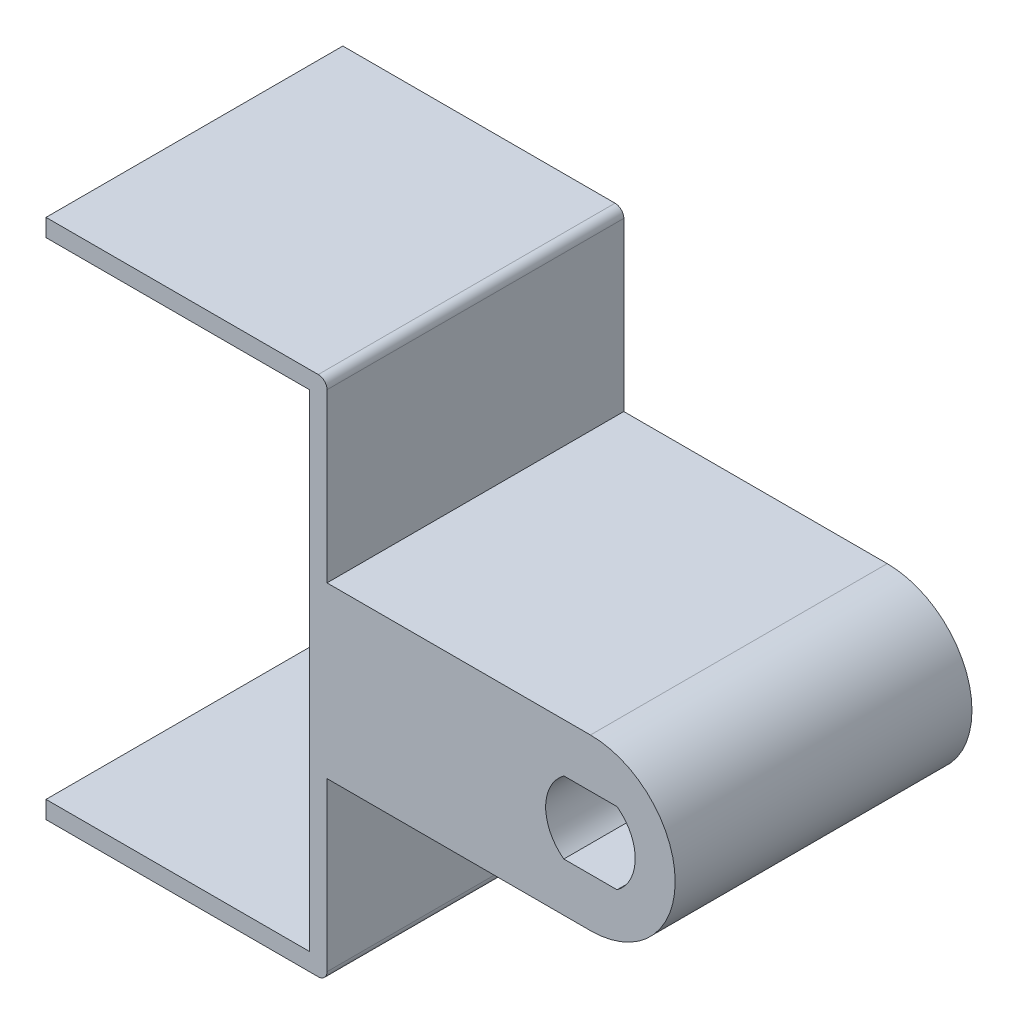
ISO-10303-21;
HEADER;
FILE_DESCRIPTION(('STEP AP214'),'2;1');
FILE_NAME('part.step','',(''),(''),'','','');
FILE_SCHEMA(('AUTOMOTIVE_DESIGN { 1 0 10303 214 1 1 1 1 }'));
ENDSEC;
DATA;
#1=APPLICATION_CONTEXT('core data for automotive mechanical design processes');
#2=APPLICATION_PROTOCOL_DEFINITION('international standard','automotive_design',2000,#1);
#3=PRODUCT_CONTEXT('',#1,'mechanical');
#4=PRODUCT('Part','Part','',(#3));
#5=PRODUCT_RELATED_PRODUCT_CATEGORY('part','',(#4));
#6=PRODUCT_DEFINITION_FORMATION('','',#4);
#7=PRODUCT_DEFINITION_CONTEXT('part definition',#1,'design');
#8=PRODUCT_DEFINITION('design','',#6,#7);
#9=PRODUCT_DEFINITION_SHAPE('','',#8);
#10=(LENGTH_UNIT() NAMED_UNIT(*) SI_UNIT(.MILLI.,.METRE.));
#11=(NAMED_UNIT(*) PLANE_ANGLE_UNIT() SI_UNIT($,.RADIAN.));
#12=(NAMED_UNIT(*) SI_UNIT($,.STERADIAN.) SOLID_ANGLE_UNIT());
#13=UNCERTAINTY_MEASURE_WITH_UNIT(LENGTH_MEASURE(1.E-05),#10,'distance_accuracy_value','');
#14=(GEOMETRIC_REPRESENTATION_CONTEXT(3) GLOBAL_UNCERTAINTY_ASSIGNED_CONTEXT((#13)) GLOBAL_UNIT_ASSIGNED_CONTEXT((#10,
#11,#12)) REPRESENTATION_CONTEXT('',''));
#15=CARTESIAN_POINT('',(0.,0.,0.));
#16=DIRECTION('',(0.,0.,1.));
#17=DIRECTION('',(1.,0.,0.));
#18=AXIS2_PLACEMENT_3D('',#15,#16,#17);
#19=CARTESIAN_POINT('',(21.,-14.85,16.9));
#20=DIRECTION('',(-1.,0.,0.));
#21=DIRECTION('',(0.,0.,1.));
#22=AXIS2_PLACEMENT_3D('',#19,#20,#21);
#23=PLANE('',#22);
#24=DIRECTION('',(0.,1.,0.));
#25=VECTOR('',#24,1.);
#26=CARTESIAN_POINT('',(21.,-14.85,0.));
#27=LINE('',#26,#25);
#28=CARTESIAN_POINT('',(21.,4.825,0.));
#29=VERTEX_POINT('',#28);
#30=CARTESIAN_POINT('',(21.,14.35,0.));
#31=VERTEX_POINT('',#30);
#32=EDGE_CURVE('E220',#29,#31,#27,.T.);
#33=ORIENTED_EDGE('',*,*,#32,.T.);
#34=DIRECTION('',(0.,0.,-1.));
#35=VECTOR('',#34,1.);
#36=CARTESIAN_POINT('',(21.,14.35,16.9));
#37=LINE('',#36,#35);
#38=CARTESIAN_POINT('',(21.,14.35,16.9));
#39=VERTEX_POINT('',#38);
#40=EDGE_CURVE('E51',#31,#39,#37,.F.);
#41=ORIENTED_EDGE('',*,*,#40,.T.);
#42=DIRECTION('',(0.,1.,0.));
#43=VECTOR('',#42,1.);
#44=CARTESIAN_POINT('',(21.,-14.85,16.9));
#45=LINE('',#44,#43);
#46=CARTESIAN_POINT('',(21.,4.825,16.9));
#47=VERTEX_POINT('',#46);
#48=EDGE_CURVE('E209',#47,#39,#45,.T.);
#49=ORIENTED_EDGE('',*,*,#48,.F.);
#50=DIRECTION('',(0.,0.,-1.));
#51=VECTOR('',#50,1.);
#52=CARTESIAN_POINT('',(21.,4.825,13.5));
#53=LINE('',#52,#51);
#54=EDGE_CURVE('E340',#47,#29,#53,.T.);
#55=ORIENTED_EDGE('',*,*,#54,.T.);
#56=EDGE_LOOP('',(#33,#41,#49,#55));
#57=FACE_BOUND('',#56,.T.);
#58=ADVANCED_FACE('F43',(#57),#23,.F.);
#59=CARTESIAN_POINT('',(21.,-14.35,16.9));
#60=VERTEX_POINT('',#59);
#61=CARTESIAN_POINT('',(21.,-4.825,16.9));
#62=VERTEX_POINT('',#61);
#63=EDGE_CURVE('E205',#60,#62,#45,.T.);
#64=ORIENTED_EDGE('',*,*,#63,.F.);
#65=DIRECTION('',(0.,0.,-1.));
#66=VECTOR('',#65,1.);
#67=CARTESIAN_POINT('',(21.,-14.35,16.9));
#68=LINE('',#67,#66);
#69=CARTESIAN_POINT('',(21.,-14.35,0.));
#70=VERTEX_POINT('',#69);
#71=EDGE_CURVE('E12',#60,#70,#68,.T.);
#72=ORIENTED_EDGE('',*,*,#71,.T.);
#73=CARTESIAN_POINT('',(21.,-4.825,0.));
#74=VERTEX_POINT('',#73);
#75=EDGE_CURVE('E222',#70,#74,#27,.T.);
#76=ORIENTED_EDGE('',*,*,#75,.T.);
#77=DIRECTION('',(0.,0.,-1.));
#78=VECTOR('',#77,1.);
#79=CARTESIAN_POINT('',(21.,-4.825,13.5));
#80=LINE('',#79,#78);
#81=EDGE_CURVE('E221',#62,#74,#80,.T.);
#82=ORIENTED_EDGE('',*,*,#81,.F.);
#83=EDGE_LOOP('',(#64,#72,#76,#82));
#84=FACE_BOUND('',#83,.T.);
#85=ADVANCED_FACE('F315',(#84),#23,.F.);
#86=CARTESIAN_POINT('',(-20.,-14.85,16.9));
#87=DIRECTION('',(0.,1.,0.));
#88=DIRECTION('',(0.,0.,1.));
#89=AXIS2_PLACEMENT_3D('',#86,#87,#88);
#90=PLANE('',#89);
#91=DIRECTION('',(1.,0.,0.));
#92=VECTOR('',#91,1.);
#93=CARTESIAN_POINT('',(-20.,-14.85,16.9));
#94=LINE('',#93,#92);
#95=CARTESIAN_POINT('',(5.,-14.85,16.9));
#96=VERTEX_POINT('',#95);
#97=CARTESIAN_POINT('',(20.5,-14.85,16.9));
#98=VERTEX_POINT('',#97);
#99=EDGE_CURVE('E232',#96,#98,#94,.T.);
#100=ORIENTED_EDGE('',*,*,#99,.F.);
#101=DIRECTION('',(0.,0.,-1.));
#102=VECTOR('',#101,1.);
#103=CARTESIAN_POINT('',(5.,-14.85,16.9));
#104=LINE('',#103,#102);
#105=CARTESIAN_POINT('',(5.,-14.85,0.));
#106=VERTEX_POINT('',#105);
#107=EDGE_CURVE('E196',#96,#106,#104,.T.);
#108=ORIENTED_EDGE('',*,*,#107,.T.);
#109=DIRECTION('',(1.,0.,0.));
#110=VECTOR('',#109,1.);
#111=CARTESIAN_POINT('',(-20.,-14.85,0.));
#112=LINE('',#111,#110);
#113=CARTESIAN_POINT('',(20.5,-14.85,0.));
#114=VERTEX_POINT('',#113);
#115=EDGE_CURVE('E218',#106,#114,#112,.T.);
#116=ORIENTED_EDGE('',*,*,#115,.T.);
#117=DIRECTION('',(0.,0.,-1.));
#118=VECTOR('',#117,1.);
#119=CARTESIAN_POINT('',(20.5,-14.85,16.9));
#120=LINE('',#119,#118);
#121=EDGE_CURVE('E337',#114,#98,#120,.F.);
#122=ORIENTED_EDGE('',*,*,#121,.T.);
#123=EDGE_LOOP('',(#100,#108,#116,#122));
#124=FACE_BOUND('',#123,.T.);
#125=ADVANCED_FACE('F321',(#124),#90,.F.);
#126=CARTESIAN_POINT('',(21.,14.85,16.9));
#127=DIRECTION('',(0.,-1.,0.));
#128=DIRECTION('',(1.,0.,0.));
#129=AXIS2_PLACEMENT_3D('',#126,#127,#128);
#130=PLANE('',#129);
#131=DIRECTION('',(-1.,0.,0.));
#132=VECTOR('',#131,1.);
#133=CARTESIAN_POINT('',(21.,14.85,0.));
#134=LINE('',#133,#132);
#135=CARTESIAN_POINT('',(20.5,14.85,0.));
#136=VERTEX_POINT('',#135);
#137=CARTESIAN_POINT('',(5.,14.85,0.));
#138=VERTEX_POINT('',#137);
#139=EDGE_CURVE('E195',#136,#138,#134,.T.);
#140=ORIENTED_EDGE('',*,*,#139,.T.);
#141=DIRECTION('',(0.,0.,-1.));
#142=VECTOR('',#141,1.);
#143=CARTESIAN_POINT('',(5.,14.85,16.9));
#144=LINE('',#143,#142);
#145=CARTESIAN_POINT('',(5.,14.85,16.9));
#146=VERTEX_POINT('',#145);
#147=EDGE_CURVE('E66',#146,#138,#144,.T.);
#148=ORIENTED_EDGE('',*,*,#147,.F.);
#149=DIRECTION('',(-1.,0.,0.));
#150=VECTOR('',#149,1.);
#151=CARTESIAN_POINT('',(21.,14.85,16.9));
#152=LINE('',#151,#150);
#153=CARTESIAN_POINT('',(20.5,14.85,16.9));
#154=VERTEX_POINT('',#153);
#155=EDGE_CURVE('E192',#154,#146,#152,.T.);
#156=ORIENTED_EDGE('',*,*,#155,.F.);
#157=DIRECTION('',(0.,0.,-1.));
#158=VECTOR('',#157,1.);
#159=CARTESIAN_POINT('',(20.5,14.85,16.9));
#160=LINE('',#159,#158);
#161=EDGE_CURVE('E698',#154,#136,#160,.T.);
#162=ORIENTED_EDGE('',*,*,#161,.T.);
#163=EDGE_LOOP('',(#140,#148,#156,#162));
#164=FACE_BOUND('',#163,.T.);
#165=ADVANCED_FACE('F190',(#164),#130,.F.);
#166=CARTESIAN_POINT('',(20.,13.85,16.9));
#167=DIRECTION('',(0.,1.,0.));
#168=DIRECTION('',(0.,0.,1.));
#169=AXIS2_PLACEMENT_3D('',#166,#167,#168);
#170=PLANE('',#169);
#171=DIRECTION('',(1.,0.,0.));
#172=VECTOR('',#171,1.);
#173=CARTESIAN_POINT('',(20.,13.85,16.9));
#174=LINE('',#173,#172);
#175=CARTESIAN_POINT('',(5.,13.85,16.9));
#176=VERTEX_POINT('',#175);
#177=CARTESIAN_POINT('',(20.,13.85,16.9));
#178=VERTEX_POINT('',#177);
#179=EDGE_CURVE('E204',#176,#178,#174,.T.);
#180=ORIENTED_EDGE('',*,*,#179,.F.);
#181=DIRECTION('',(0.,0.,-1.));
#182=VECTOR('',#181,1.);
#183=CARTESIAN_POINT('',(5.,13.85,16.9));
#184=LINE('',#183,#182);
#185=CARTESIAN_POINT('',(5.,13.85,0.));
#186=VERTEX_POINT('',#185);
#187=EDGE_CURVE('E181',#176,#186,#184,.T.);
#188=ORIENTED_EDGE('',*,*,#187,.T.);
#189=DIRECTION('',(1.,0.,0.));
#190=VECTOR('',#189,1.);
#191=CARTESIAN_POINT('',(20.,13.85,0.));
#192=LINE('',#191,#190);
#193=CARTESIAN_POINT('',(20.,13.85,0.));
#194=VERTEX_POINT('',#193);
#195=EDGE_CURVE('E225',#186,#194,#192,.T.);
#196=ORIENTED_EDGE('',*,*,#195,.T.);
#197=DIRECTION('',(0.,0.,-1.));
#198=VECTOR('',#197,1.);
#199=CARTESIAN_POINT('',(20.,13.85,16.9));
#200=LINE('',#199,#198);
#201=EDGE_CURVE('E235',#178,#194,#200,.T.);
#202=ORIENTED_EDGE('',*,*,#201,.F.);
#203=EDGE_LOOP('',(#180,#188,#196,#202));
#204=FACE_BOUND('',#203,.T.);
#205=ADVANCED_FACE('F331',(#204),#170,.F.);
#206=CARTESIAN_POINT('',(20.,-13.85,16.9));
#207=DIRECTION('',(1.,0.,0.));
#208=DIRECTION('',(0.,0.,-1.));
#209=AXIS2_PLACEMENT_3D('',#206,#207,#208);
#210=PLANE('',#209);
#211=DIRECTION('',(0.,-1.,0.));
#212=VECTOR('',#211,1.);
#213=CARTESIAN_POINT('',(20.,-13.85,0.));
#214=LINE('',#213,#212);
#215=CARTESIAN_POINT('',(20.,-13.85,0.));
#216=VERTEX_POINT('',#215);
#217=EDGE_CURVE('E227',#194,#216,#214,.T.);
#218=ORIENTED_EDGE('',*,*,#217,.T.);
#219=DIRECTION('',(0.,0.,-1.));
#220=VECTOR('',#219,1.);
#221=CARTESIAN_POINT('',(20.,-13.85,16.9));
#222=LINE('',#221,#220);
#223=CARTESIAN_POINT('',(20.,-13.85,16.9));
#224=VERTEX_POINT('',#223);
#225=EDGE_CURVE('E217',#224,#216,#222,.T.);
#226=ORIENTED_EDGE('',*,*,#225,.F.);
#227=DIRECTION('',(0.,-1.,0.));
#228=VECTOR('',#227,1.);
#229=CARTESIAN_POINT('',(20.,-13.85,16.9));
#230=LINE('',#229,#228);
#231=EDGE_CURVE('E207',#178,#224,#230,.T.);
#232=ORIENTED_EDGE('',*,*,#231,.F.);
#233=ORIENTED_EDGE('',*,*,#201,.T.);
#234=EDGE_LOOP('',(#218,#226,#232,#233));
#235=FACE_BOUND('',#234,.T.);
#236=ADVANCED_FACE('F413',(#235),#210,.F.);
#237=CARTESIAN_POINT('',(-20.,-13.85,16.9));
#238=DIRECTION('',(0.,-1.,0.));
#239=DIRECTION('',(0.,0.,-1.));
#240=AXIS2_PLACEMENT_3D('',#237,#238,#239);
#241=PLANE('',#240);
#242=DIRECTION('',(-1.,0.,0.));
#243=VECTOR('',#242,1.);
#244=CARTESIAN_POINT('',(-20.,-13.85,0.));
#245=LINE('',#244,#243);
#246=CARTESIAN_POINT('',(5.,-13.85,0.));
#247=VERTEX_POINT('',#246);
#248=EDGE_CURVE('E229',#216,#247,#245,.T.);
#249=ORIENTED_EDGE('',*,*,#248,.T.);
#250=DIRECTION('',(0.,0.,1.));
#251=VECTOR('',#250,1.);
#252=CARTESIAN_POINT('',(5.,-13.85,16.9));
#253=LINE('',#252,#251);
#254=CARTESIAN_POINT('',(5.,-13.85,16.9));
#255=VERTEX_POINT('',#254);
#256=EDGE_CURVE('E58',#247,#255,#253,.T.);
#257=ORIENTED_EDGE('',*,*,#256,.T.);
#258=DIRECTION('',(-1.,0.,0.));
#259=VECTOR('',#258,1.);
#260=CARTESIAN_POINT('',(-20.,-13.85,16.9));
#261=LINE('',#260,#259);
#262=EDGE_CURVE('E214',#224,#255,#261,.T.);
#263=ORIENTED_EDGE('',*,*,#262,.F.);
#264=ORIENTED_EDGE('',*,*,#225,.T.);
#265=EDGE_LOOP('',(#249,#257,#263,#264));
#266=FACE_BOUND('',#265,.T.);
#267=ADVANCED_FACE('F408',(#266),#241,.F.);
#268=CARTESIAN_POINT('',(0.,0.,16.9));
#269=DIRECTION('',(0.,0.,1.));
#270=DIRECTION('',(1.,0.,0.));
#271=AXIS2_PLACEMENT_3D('',#268,#269,#270);
#272=PLANE('',#271);
#273=DIRECTION('',(0.,-1.,0.));
#274=VECTOR('',#273,1.);
#275=CARTESIAN_POINT('',(5.,14.85,16.9));
#276=LINE('',#275,#274);
#277=EDGE_CURVE('E185',#255,#96,#276,.T.);
#278=ORIENTED_EDGE('',*,*,#277,.T.);
#279=ORIENTED_EDGE('',*,*,#99,.T.);
#280=CARTESIAN_POINT('',(20.5,-14.35,16.9));
#281=DIRECTION('',(0.,0.,1.));
#282=DIRECTION('',(1.,0.,0.));
#283=AXIS2_PLACEMENT_3D('',#280,#281,#282);
#284=CIRCLE('',#283,0.5);
#285=EDGE_CURVE('E700',#98,#60,#284,.T.);
#286=ORIENTED_EDGE('',*,*,#285,.T.);
#287=ORIENTED_EDGE('',*,*,#63,.T.);
#288=DIRECTION('',(1.,0.,0.));
#289=VECTOR('',#288,1.);
#290=CARTESIAN_POINT('',(21.,-4.825,16.9));
#291=LINE('',#290,#289);
#292=CARTESIAN_POINT('',(36.,-4.825,16.9));
#293=VERTEX_POINT('',#292);
#294=EDGE_CURVE('E358',#62,#293,#291,.T.);
#295=ORIENTED_EDGE('',*,*,#294,.T.);
#296=CARTESIAN_POINT('',(36.,0.,16.9));
#297=DIRECTION('',(0.,0.,1.));
#298=DIRECTION('',(1.,0.,0.));
#299=AXIS2_PLACEMENT_3D('',#296,#297,#298);
#300=CIRCLE('',#299,4.825);
#301=CARTESIAN_POINT('',(36.,4.825,16.9));
#302=VERTEX_POINT('',#301);
#303=EDGE_CURVE('E359',#293,#302,#300,.T.);
#304=ORIENTED_EDGE('',*,*,#303,.T.);
#305=DIRECTION('',(-1.,0.,0.));
#306=VECTOR('',#305,1.);
#307=CARTESIAN_POINT('',(36.,4.825,16.9));
#308=LINE('',#307,#306);
#309=EDGE_CURVE('E362',#302,#47,#308,.T.);
#310=ORIENTED_EDGE('',*,*,#309,.T.);
#311=ORIENTED_EDGE('',*,*,#48,.T.);
#312=CARTESIAN_POINT('',(20.5,14.35,16.9));
#313=DIRECTION('',(0.,0.,1.));
#314=DIRECTION('',(1.,0.,0.));
#315=AXIS2_PLACEMENT_3D('',#312,#313,#314);
#316=CIRCLE('',#315,0.5);
#317=EDGE_CURVE('E203',#39,#154,#316,.T.);
#318=ORIENTED_EDGE('',*,*,#317,.T.);
#319=ORIENTED_EDGE('',*,*,#155,.T.);
#320=EDGE_CURVE('E178',#146,#176,#276,.T.);
#321=ORIENTED_EDGE('',*,*,#320,.T.);
#322=ORIENTED_EDGE('',*,*,#179,.T.);
#323=ORIENTED_EDGE('',*,*,#231,.T.);
#324=ORIENTED_EDGE('',*,*,#262,.T.);
#325=EDGE_LOOP('',(#278,#279,#286,#287,#295,#304,#310,#311,#318,#319,#321,#322,#323,#324));
#326=FACE_BOUND('',#325,.T.);
#327=CARTESIAN_POINT('',(36.,2.4980018054066E-13,16.9));
#328=DIRECTION('',(0.,0.,-1.));
#329=DIRECTION('',(-1.,0.,0.));
#330=AXIS2_PLACEMENT_3D('',#327,#328,#329);
#331=CIRCLE('',#330,2.55000000000028);
#332=CARTESIAN_POINT('',(34.4834249111896,-2.05,16.9));
#333=VERTEX_POINT('',#332);
#334=CARTESIAN_POINT('',(34.4834249111889,2.05,16.9));
#335=VERTEX_POINT('',#334);
#336=EDGE_CURVE('E393',#333,#335,#331,.T.);
#337=ORIENTED_EDGE('',*,*,#336,.T.);
#338=DIRECTION('',(1.,0.,0.));
#339=VECTOR('',#338,1.);
#340=CARTESIAN_POINT('',(34.4834249111889,2.05,16.9));
#341=LINE('',#340,#339);
#342=CARTESIAN_POINT('',(37.5165750888108,2.05,16.9));
#343=VERTEX_POINT('',#342);
#344=EDGE_CURVE('E390',#335,#343,#341,.T.);
#345=ORIENTED_EDGE('',*,*,#344,.T.);
#346=CARTESIAN_POINT('',(36.,2.4980018054066E-13,16.9));
#347=DIRECTION('',(0.,0.,-1.));
#348=DIRECTION('',(-1.,0.,0.));
#349=AXIS2_PLACEMENT_3D('',#346,#347,#348);
#350=CIRCLE('',#349,2.5500000000001);
#351=CARTESIAN_POINT('',(37.5165750888102,-2.05,16.9));
#352=VERTEX_POINT('',#351);
#353=EDGE_CURVE('E387',#343,#352,#350,.T.);
#354=ORIENTED_EDGE('',*,*,#353,.T.);
#355=DIRECTION('',(-1.,0.,0.));
#356=VECTOR('',#355,1.);
#357=CARTESIAN_POINT('',(37.5165750888102,-2.05,16.9));
#358=LINE('',#357,#356);
#359=EDGE_CURVE('E378',#352,#333,#358,.T.);
#360=ORIENTED_EDGE('',*,*,#359,.T.);
#361=EDGE_LOOP('',(#337,#345,#354,#360));
#362=FACE_BOUND('',#361,.T.);
#363=ADVANCED_FACE('F199',(#326,#362),#272,.T.);
#364=CARTESIAN_POINT('',(0.,0.,0.));
#365=DIRECTION('',(0.,0.,1.));
#366=DIRECTION('',(1.,0.,0.));
#367=AXIS2_PLACEMENT_3D('',#364,#365,#366);
#368=PLANE('',#367);
#369=DIRECTION('',(1.,0.,0.));
#370=VECTOR('',#369,1.);
#371=CARTESIAN_POINT('',(37.5,-3.15470053837926,0.));
#372=LINE('',#371,#370);
#373=CARTESIAN_POINT('',(34.1548169363503,-3.15470053837926,0.));
#374=VERTEX_POINT('',#373);
#375=CARTESIAN_POINT('',(37.8451830636492,-3.15470053837926,0.));
#376=VERTEX_POINT('',#375);
#377=EDGE_CURVE('E243',#374,#376,#372,.T.);
#378=ORIENTED_EDGE('',*,*,#377,.T.);
#379=CARTESIAN_POINT('',(36.,2.4980018054066E-13,0.));
#380=DIRECTION('',(0.,0.,1.));
#381=DIRECTION('',(1.,0.,0.));
#382=AXIS2_PLACEMENT_3D('',#379,#380,#381);
#383=CIRCLE('',#382,3.65470053837926);
#384=CARTESIAN_POINT('',(37.84518306365,3.15470053837926,0.));
#385=VERTEX_POINT('',#384);
#386=EDGE_CURVE('E245',#376,#385,#383,.T.);
#387=ORIENTED_EDGE('',*,*,#386,.T.);
#388=DIRECTION('',(-1.,0.,0.));
#389=VECTOR('',#388,1.);
#390=CARTESIAN_POINT('',(34.4999999999996,3.15470053837926,0.));
#391=LINE('',#390,#389);
#392=CARTESIAN_POINT('',(34.1548169363495,3.15470053837926,0.));
#393=VERTEX_POINT('',#392);
#394=EDGE_CURVE('E238',#385,#393,#391,.T.);
#395=ORIENTED_EDGE('',*,*,#394,.T.);
#396=CARTESIAN_POINT('',(36.,2.4980018054066E-13,0.));
#397=DIRECTION('',(0.,0.,1.));
#398=DIRECTION('',(1.,0.,0.));
#399=AXIS2_PLACEMENT_3D('',#396,#397,#398);
#400=CIRCLE('',#399,3.65470053837953);
#401=EDGE_CURVE('E241',#393,#374,#400,.T.);
#402=ORIENTED_EDGE('',*,*,#401,.T.);
#403=EDGE_LOOP('',(#378,#387,#395,#402));
#404=FACE_BOUND('',#403,.T.);
#405=ORIENTED_EDGE('',*,*,#115,.F.);
#406=DIRECTION('',(0.,-1.,0.));
#407=VECTOR('',#406,1.);
#408=CARTESIAN_POINT('',(5.,14.85,0.));
#409=LINE('',#408,#407);
#410=EDGE_CURVE('E400',#247,#106,#409,.T.);
#411=ORIENTED_EDGE('',*,*,#410,.F.);
#412=ORIENTED_EDGE('',*,*,#248,.F.);
#413=ORIENTED_EDGE('',*,*,#217,.F.);
#414=ORIENTED_EDGE('',*,*,#195,.F.);
#415=EDGE_CURVE('E399',#138,#186,#409,.T.);
#416=ORIENTED_EDGE('',*,*,#415,.F.);
#417=ORIENTED_EDGE('',*,*,#139,.F.);
#418=CARTESIAN_POINT('',(20.5,14.35,0.));
#419=DIRECTION('',(0.,0.,1.));
#420=DIRECTION('',(1.,0.,0.));
#421=AXIS2_PLACEMENT_3D('',#418,#419,#420);
#422=CIRCLE('',#421,0.5);
#423=EDGE_CURVE('E694',#136,#31,#422,.F.);
#424=ORIENTED_EDGE('',*,*,#423,.T.);
#425=ORIENTED_EDGE('',*,*,#32,.F.);
#426=DIRECTION('',(1.,0.,0.));
#427=VECTOR('',#426,1.);
#428=CARTESIAN_POINT('',(21.,4.825,0.));
#429=LINE('',#428,#427);
#430=CARTESIAN_POINT('',(36.,4.825,0.));
#431=VERTEX_POINT('',#430);
#432=EDGE_CURVE('E355',#29,#431,#429,.T.);
#433=ORIENTED_EDGE('',*,*,#432,.T.);
#434=CARTESIAN_POINT('',(36.,0.,0.));
#435=DIRECTION('',(0.,0.,-1.));
#436=DIRECTION('',(-1.,0.,0.));
#437=AXIS2_PLACEMENT_3D('',#434,#435,#436);
#438=CIRCLE('',#437,4.825);
#439=CARTESIAN_POINT('',(36.,-4.825,0.));
#440=VERTEX_POINT('',#439);
#441=EDGE_CURVE('E353',#431,#440,#438,.T.);
#442=ORIENTED_EDGE('',*,*,#441,.T.);
#443=DIRECTION('',(-1.,0.,0.));
#444=VECTOR('',#443,1.);
#445=CARTESIAN_POINT('',(36.,-4.825,0.));
#446=LINE('',#445,#444);
#447=EDGE_CURVE('E344',#440,#74,#446,.T.);
#448=ORIENTED_EDGE('',*,*,#447,.T.);
#449=ORIENTED_EDGE('',*,*,#75,.F.);
#450=CARTESIAN_POINT('',(20.5,-14.35,0.));
#451=DIRECTION('',(0.,0.,1.));
#452=DIRECTION('',(1.,0.,0.));
#453=AXIS2_PLACEMENT_3D('',#450,#451,#452);
#454=CIRCLE('',#453,0.5);
#455=EDGE_CURVE('E693',#70,#114,#454,.F.);
#456=ORIENTED_EDGE('',*,*,#455,.T.);
#457=EDGE_LOOP('',(#405,#411,#412,#413,#414,#416,#417,#424,#425,#433,#442,#448,#449,#456));
#458=FACE_BOUND('',#457,.T.);
#459=ADVANCED_FACE('F404',(#404,#458),#368,.F.);
#460=CARTESIAN_POINT('',(36.,-4.825,13.5));
#461=DIRECTION('',(0.,-1.,0.));
#462=DIRECTION('',(1.,0.,0.));
#463=AXIS2_PLACEMENT_3D('',#460,#461,#462);
#464=PLANE('',#463);
#465=ORIENTED_EDGE('',*,*,#447,.F.);
#466=DIRECTION('',(0.,0.,-1.));
#467=VECTOR('',#466,1.);
#468=CARTESIAN_POINT('',(36.,-4.825,13.5));
#469=LINE('',#468,#467);
#470=EDGE_CURVE('E346',#293,#440,#469,.T.);
#471=ORIENTED_EDGE('',*,*,#470,.F.);
#472=ORIENTED_EDGE('',*,*,#294,.F.);
#473=ORIENTED_EDGE('',*,*,#81,.T.);
#474=EDGE_LOOP('',(#465,#471,#472,#473));
#475=FACE_BOUND('',#474,.T.);
#476=ADVANCED_FACE('F427',(#475),#464,.T.);
#477=CARTESIAN_POINT('',(36.,0.,13.5));
#478=DIRECTION('',(0.,0.,-1.));
#479=DIRECTION('',(-1.,0.,0.));
#480=AXIS2_PLACEMENT_3D('',#477,#478,#479);
#481=CYLINDRICAL_SURFACE('',#480,4.825);
#482=ORIENTED_EDGE('',*,*,#470,.T.);
#483=ORIENTED_EDGE('',*,*,#441,.F.);
#484=DIRECTION('',(0.,0.,-1.));
#485=VECTOR('',#484,1.);
#486=CARTESIAN_POINT('',(36.,4.825,13.5));
#487=LINE('',#486,#485);
#488=EDGE_CURVE('E343',#302,#431,#487,.T.);
#489=ORIENTED_EDGE('',*,*,#488,.F.);
#490=ORIENTED_EDGE('',*,*,#303,.F.);
#491=EDGE_LOOP('',(#482,#483,#489,#490));
#492=FACE_BOUND('',#491,.T.);
#493=ADVANCED_FACE('F433',(#492),#481,.T.);
#494=CARTESIAN_POINT('',(21.,4.825,13.5));
#495=DIRECTION('',(0.,1.,0.));
#496=DIRECTION('',(-1.,0.,0.));
#497=AXIS2_PLACEMENT_3D('',#494,#495,#496);
#498=PLANE('',#497);
#499=ORIENTED_EDGE('',*,*,#432,.F.);
#500=ORIENTED_EDGE('',*,*,#54,.F.);
#501=ORIENTED_EDGE('',*,*,#309,.F.);
#502=ORIENTED_EDGE('',*,*,#488,.T.);
#503=EDGE_LOOP('',(#499,#500,#501,#502));
#504=FACE_BOUND('',#503,.T.);
#505=ADVANCED_FACE('F299',(#504),#498,.T.);
#506=CARTESIAN_POINT('',(36.,2.4980018054066E-13,0.));
#507=DIRECTION('',(0.,0.,-1.));
#508=DIRECTION('',(-1.,0.,0.));
#509=AXIS2_PLACEMENT_3D('',#506,#507,#508);
#510=CONICAL_SURFACE('',#509,3.65470053837953,0.523598775598297);
#511=CARTESIAN_POINT('',(36.,2.4980018054066E-13,1.91339745962157));
#512=DIRECTION('',(0.,0.,-1.));
#513=DIRECTION('',(-1.,0.,0.));
#514=AXIS2_PLACEMENT_3D('',#511,#512,#513);
#515=CIRCLE('',#514,2.55000000000028);
#516=CARTESIAN_POINT('',(34.4834249111896,-2.05,1.91339745962157));
#517=VERTEX_POINT('',#516);
#518=CARTESIAN_POINT('',(34.4834249111889,2.05,1.91339745962157));
#519=VERTEX_POINT('',#518);
#520=EDGE_CURVE('E258',#517,#519,#515,.T.);
#521=ORIENTED_EDGE('',*,*,#520,.F.);
#522=CARTESIAN_POINT('',(34.4999999999996,-2.,2.00000000000002));
#523=CARTESIAN_POINT('',(34.4680206898571,-2.09597972634379,1.83375823747601));
#524=CARTESIAN_POINT('',(34.4370098038124,-2.19203881554799,1.66737901444555));
#525=CARTESIAN_POINT('',(34.3766687192747,-2.38428346218164,1.33440151899294));
#526=CARTESIAN_POINT('',(34.3473384251926,-2.48046901209928,1.16780325958164));
#527=CARTESIAN_POINT('',(34.2900995127356,-2.67294279803823,0.83442888321023));
#528=CARTESIAN_POINT('',(34.2621908580411,-2.76923103137202,0.66765277090507));
#529=CARTESIAN_POINT('',(34.2076158956177,-2.96190114716729,0.33393834124748));
#530=CARTESIAN_POINT('',(34.1809496584722,-3.05828303463261,0.167000015228157));
#531=CARTESIAN_POINT('',(34.1548169363503,-3.15470053837926,0.));
#532=B_SPLINE_CURVE_WITH_KNOTS('',3,(#522,#523,#524,#525,#526,#527,#528,#529,#530,#531),
.UNSPECIFIED.,.F.,.F.,(4,2,2,2,4),(0.,0.583808837990597,1.16758443697856,1.75134511441586,
2.33513891566343),.UNSPECIFIED.);
#533=EDGE_CURVE('E287',#374,#517,#532,.F.);
#534=ORIENTED_EDGE('',*,*,#533,.F.);
#535=ORIENTED_EDGE('',*,*,#401,.F.);
#536=CARTESIAN_POINT('',(34.4999999999996,2.,2.00000000000002));
#537=CARTESIAN_POINT('',(34.4680206898566,2.09597972634376,1.83375823747606));
#538=CARTESIAN_POINT('',(34.4370098038118,2.19203881554795,1.66737901444561));
#539=CARTESIAN_POINT('',(34.3766687192739,2.3842834621816,1.33440151899301));
#540=CARTESIAN_POINT('',(34.3473384251919,2.48046901209924,1.1678032595817));
#541=CARTESIAN_POINT('',(34.2900995127348,2.67294279803821,0.834428883210265));
#542=CARTESIAN_POINT('',(34.2621908580403,2.769231031372,0.667652770905099));
#543=CARTESIAN_POINT('',(34.2076158956169,2.96190114716728,0.333938341247497));
#544=CARTESIAN_POINT('',(34.1809496584713,3.05828303463261,0.167000015228168));
#545=CARTESIAN_POINT('',(34.1548169363495,3.15470053837926,0.));
#546=B_SPLINE_CURVE_WITH_KNOTS('',3,(#536,#537,#538,#539,#540,#541,#542,#543,#544,#545),
.UNSPECIFIED.,.F.,.F.,(4,2,2,2,4),(0.,0.583808837990634,1.16758443697863,1.75134511441596,
2.33513891566356),.UNSPECIFIED.);
#547=EDGE_CURVE('E281',#519,#393,#546,.T.);
#548=ORIENTED_EDGE('',*,*,#547,.F.);
#549=EDGE_LOOP('',(#521,#534,#535,#548));
#550=FACE_BOUND('',#549,.T.);
#551=ADVANCED_FACE('F294',(#550),#510,.F.);
#552=CARTESIAN_POINT('',(0.,-3.15470053837926,0.));
#553=DIRECTION('',(0.,0.866025403784439,-0.5));
#554=DIRECTION('',(-1.,0.,0.));
#555=AXIS2_PLACEMENT_3D('',#552,#553,#554);
#556=PLANE('',#555);
#557=DIRECTION('',(-1.,0.,0.));
#558=VECTOR('',#557,1.);
#559=CARTESIAN_POINT('',(0.,-2.05,1.91339745962157));
#560=LINE('',#559,#558);
#561=CARTESIAN_POINT('',(37.5165750888102,-2.05,1.9133974596214));
#562=VERTEX_POINT('',#561);
#563=EDGE_CURVE('E368',#562,#517,#560,.T.);
#564=ORIENTED_EDGE('',*,*,#563,.F.);
#565=CARTESIAN_POINT('',(37.5,-2.,2.00000000000002));
#566=CARTESIAN_POINT('',(37.5319793101425,-2.09597972634379,1.83375823747601));
#567=CARTESIAN_POINT('',(37.5629901961872,-2.19203881554799,1.66737901444555));
#568=CARTESIAN_POINT('',(37.6233312807249,-2.38428346218164,1.33440151899294));
#569=CARTESIAN_POINT('',(37.6526615748069,-2.48046901209928,1.16780325958165));
#570=CARTESIAN_POINT('',(37.709900487264,-2.67294279803823,0.83442888321023));
#571=CARTESIAN_POINT('',(37.7378091419585,-2.76923103137202,0.66765277090507));
#572=CARTESIAN_POINT('',(37.7923841043818,-2.96190114716729,0.33393834124748));
#573=CARTESIAN_POINT('',(37.8190503415273,-3.05828303463261,0.167000015228157));
#574=CARTESIAN_POINT('',(37.8451830636492,-3.15470053837926,0.));
#575=B_SPLINE_CURVE_WITH_KNOTS('',3,(#565,#566,#567,#568,#569,#570,#571,#572,#573,#574),
.UNSPECIFIED.,.F.,.F.,(4,2,2,2,4),(0.,0.583808837990592,1.16758443697856,1.75134511441585,
2.33513891566342),.UNSPECIFIED.);
#576=EDGE_CURVE('E257',#376,#562,#575,.F.);
#577=ORIENTED_EDGE('',*,*,#576,.F.);
#578=ORIENTED_EDGE('',*,*,#377,.F.);
#579=ORIENTED_EDGE('',*,*,#533,.T.);
#580=EDGE_LOOP('',(#564,#577,#578,#579));
#581=FACE_BOUND('',#580,.T.);
#582=ADVANCED_FACE('F276',(#581),#556,.T.);
#583=CARTESIAN_POINT('',(0.,3.15470053837926,0.));
#584=DIRECTION('',(0.,-0.866025403784439,-0.5));
#585=DIRECTION('',(1.,0.,0.));
#586=AXIS2_PLACEMENT_3D('',#583,#584,#585);
#587=PLANE('',#586);
#588=DIRECTION('',(1.,0.,0.));
#589=VECTOR('',#588,1.);
#590=CARTESIAN_POINT('',(0.,2.04999999999999,1.91339745962158));
#591=LINE('',#590,#589);
#592=CARTESIAN_POINT('',(37.5165750888107,2.05000000000024,1.91339745962115));
#593=VERTEX_POINT('',#592);
#594=EDGE_CURVE('E370',#519,#593,#591,.T.);
#595=ORIENTED_EDGE('',*,*,#594,.F.);
#596=ORIENTED_EDGE('',*,*,#547,.T.);
#597=ORIENTED_EDGE('',*,*,#394,.F.);
#598=CARTESIAN_POINT('',(37.84518306365,3.15470053837926,0.));
#599=CARTESIAN_POINT('',(37.8190503415281,3.05828303463261,0.16700001522816));
#600=CARTESIAN_POINT('',(37.7923841043826,2.96190114716729,0.333938341247482));
#601=CARTESIAN_POINT('',(37.7378091419593,2.76923103137202,0.667652770905071));
#602=CARTESIAN_POINT('',(37.7099004872647,2.67294279803824,0.834428883210229));
#603=CARTESIAN_POINT('',(37.6526615748077,2.48046901209927,1.16780325958165));
#604=CARTESIAN_POINT('',(37.6233312807256,2.38428346218164,1.33440151899295));
#605=CARTESIAN_POINT('',(37.5629901961878,2.19203881554799,1.66737901444554));
#606=CARTESIAN_POINT('',(37.5319793101431,2.0959797263438,1.83375823747599));
#607=CARTESIAN_POINT('',(37.5000000000004,2.00000000000003,1.99999999999997));
#608=B_SPLINE_CURVE_WITH_KNOTS('',3,(#598,#599,#600,#601,#602,#603,#604,#605,#606,#607),
.UNSPECIFIED.,.F.,.F.,(4,2,2,2,4),(0.,0.583793801247576,1.16755447868487,1.75133007767284,
2.33513891566344),.UNSPECIFIED.);
#609=EDGE_CURVE('E249',#593,#385,#608,.F.);
#610=ORIENTED_EDGE('',*,*,#609,.F.);
#611=EDGE_LOOP('',(#595,#596,#597,#610));
#612=FACE_BOUND('',#611,.T.);
#613=ADVANCED_FACE('F270',(#612),#587,.T.);
#614=CARTESIAN_POINT('',(36.,2.4980018054066E-13,0.));
#615=DIRECTION('',(0.,0.,-1.));
#616=DIRECTION('',(-1.,0.,0.));
#617=AXIS2_PLACEMENT_3D('',#614,#615,#616);
#618=CONICAL_SURFACE('',#617,3.65470053837926,0.523598775598297);
#619=CARTESIAN_POINT('',(36.,2.4980018054066E-13,1.9133974596214));
#620=DIRECTION('',(0.,0.,-1.));
#621=DIRECTION('',(-1.,0.,0.));
#622=AXIS2_PLACEMENT_3D('',#619,#620,#621);
#623=CIRCLE('',#622,2.5500000000001);
#624=EDGE_CURVE('E248',#593,#562,#623,.T.);
#625=ORIENTED_EDGE('',*,*,#624,.F.);
#626=ORIENTED_EDGE('',*,*,#609,.T.);
#627=ORIENTED_EDGE('',*,*,#386,.F.);
#628=ORIENTED_EDGE('',*,*,#576,.T.);
#629=EDGE_LOOP('',(#625,#626,#627,#628));
#630=FACE_BOUND('',#629,.T.);
#631=ADVANCED_FACE('F266',(#630),#618,.F.);
#632=CARTESIAN_POINT('',(36.,2.4980018054066E-13,16.9));
#633=DIRECTION('',(0.,0.,-1.));
#634=DIRECTION('',(-1.,0.,0.));
#635=AXIS2_PLACEMENT_3D('',#632,#633,#634);
#636=CYLINDRICAL_SURFACE('',#635,2.55000000000028);
#637=ORIENTED_EDGE('',*,*,#520,.T.);
#638=DIRECTION('',(0.,0.,-1.));
#639=VECTOR('',#638,1.);
#640=CARTESIAN_POINT('',(34.4834249111889,2.05,16.9));
#641=LINE('',#640,#639);
#642=EDGE_CURVE('E374',#335,#519,#641,.T.);
#643=ORIENTED_EDGE('',*,*,#642,.F.);
#644=ORIENTED_EDGE('',*,*,#336,.F.);
#645=DIRECTION('',(0.,0.,-1.));
#646=VECTOR('',#645,1.);
#647=CARTESIAN_POINT('',(34.4834249111896,-2.05,16.9));
#648=LINE('',#647,#646);
#649=EDGE_CURVE('E373',#333,#517,#648,.T.);
#650=ORIENTED_EDGE('',*,*,#649,.T.);
#651=EDGE_LOOP('',(#637,#643,#644,#650));
#652=FACE_BOUND('',#651,.T.);
#653=ADVANCED_FACE('F441',(#652),#636,.F.);
#654=CARTESIAN_POINT('',(37.5165750888102,-2.05,16.9));
#655=DIRECTION('',(0.,-1.,0.));
#656=DIRECTION('',(0.,0.,-1.));
#657=AXIS2_PLACEMENT_3D('',#654,#655,#656);
#658=PLANE('',#657);
#659=ORIENTED_EDGE('',*,*,#563,.T.);
#660=ORIENTED_EDGE('',*,*,#649,.F.);
#661=ORIENTED_EDGE('',*,*,#359,.F.);
#662=DIRECTION('',(0.,0.,-1.));
#663=VECTOR('',#662,1.);
#664=CARTESIAN_POINT('',(37.5165750888102,-2.05,16.9));
#665=LINE('',#664,#663);
#666=EDGE_CURVE('E380',#352,#562,#665,.T.);
#667=ORIENTED_EDGE('',*,*,#666,.T.);
#668=EDGE_LOOP('',(#659,#660,#661,#667));
#669=FACE_BOUND('',#668,.T.);
#670=ADVANCED_FACE('F443',(#669),#658,.F.);
#671=CARTESIAN_POINT('',(36.,2.4980018054066E-13,16.9));
#672=DIRECTION('',(0.,0.,-1.));
#673=DIRECTION('',(-1.,0.,0.));
#674=AXIS2_PLACEMENT_3D('',#671,#672,#673);
#675=CYLINDRICAL_SURFACE('',#674,2.5500000000001);
#676=ORIENTED_EDGE('',*,*,#624,.T.);
#677=ORIENTED_EDGE('',*,*,#666,.F.);
#678=ORIENTED_EDGE('',*,*,#353,.F.);
#679=DIRECTION('',(0.,0.,-1.));
#680=VECTOR('',#679,1.);
#681=CARTESIAN_POINT('',(37.5165750888108,2.05,16.9));
#682=LINE('',#681,#680);
#683=EDGE_CURVE('E377',#343,#593,#682,.T.);
#684=ORIENTED_EDGE('',*,*,#683,.T.);
#685=EDGE_LOOP('',(#676,#677,#678,#684));
#686=FACE_BOUND('',#685,.T.);
#687=ADVANCED_FACE('F311',(#686),#675,.F.);
#688=CARTESIAN_POINT('',(34.4834249111889,2.05,16.9));
#689=DIRECTION('',(0.,1.,0.));
#690=DIRECTION('',(-1.,0.,0.));
#691=AXIS2_PLACEMENT_3D('',#688,#689,#690);
#692=PLANE('',#691);
#693=ORIENTED_EDGE('',*,*,#594,.T.);
#694=ORIENTED_EDGE('',*,*,#683,.F.);
#695=ORIENTED_EDGE('',*,*,#344,.F.);
#696=ORIENTED_EDGE('',*,*,#642,.T.);
#697=EDGE_LOOP('',(#693,#694,#695,#696));
#698=FACE_BOUND('',#697,.T.);
#699=ADVANCED_FACE('F304',(#698),#692,.F.);
#700=CARTESIAN_POINT('',(20.5,14.35,16.9));
#701=DIRECTION('',(0.,0.,-1.));
#702=DIRECTION('',(-1.,0.,0.));
#703=AXIS2_PLACEMENT_3D('',#700,#701,#702);
#704=CYLINDRICAL_SURFACE('',#703,0.5);
#705=ORIENTED_EDGE('',*,*,#317,.F.);
#706=ORIENTED_EDGE('',*,*,#40,.F.);
#707=ORIENTED_EDGE('',*,*,#423,.F.);
#708=ORIENTED_EDGE('',*,*,#161,.F.);
#709=EDGE_LOOP('',(#705,#706,#707,#708));
#710=FACE_BOUND('',#709,.T.);
#711=ADVANCED_FACE('F301',(#710),#704,.T.);
#712=CARTESIAN_POINT('',(20.5,-14.35,16.9));
#713=DIRECTION('',(0.,0.,-1.));
#714=DIRECTION('',(-1.,0.,0.));
#715=AXIS2_PLACEMENT_3D('',#712,#713,#714);
#716=CYLINDRICAL_SURFACE('',#715,0.5);
#717=ORIENTED_EDGE('',*,*,#285,.F.);
#718=ORIENTED_EDGE('',*,*,#121,.F.);
#719=ORIENTED_EDGE('',*,*,#455,.F.);
#720=ORIENTED_EDGE('',*,*,#71,.F.);
#721=EDGE_LOOP('',(#717,#718,#719,#720));
#722=FACE_BOUND('',#721,.T.);
#723=ADVANCED_FACE('F45',(#722),#716,.T.);
#724=CARTESIAN_POINT('',(5.,14.85,16.9));
#725=DIRECTION('',(1.,0.,0.));
#726=DIRECTION('',(0.,1.,0.));
#727=AXIS2_PLACEMENT_3D('',#724,#725,#726);
#728=PLANE('',#727);
#729=ORIENTED_EDGE('',*,*,#320,.F.);
#730=ORIENTED_EDGE('',*,*,#147,.T.);
#731=ORIENTED_EDGE('',*,*,#415,.T.);
#732=ORIENTED_EDGE('',*,*,#187,.F.);
#733=EDGE_LOOP('',(#729,#730,#731,#732));
#734=FACE_BOUND('',#733,.T.);
#735=ADVANCED_FACE('F179',(#734),#728,.F.);
#736=ORIENTED_EDGE('',*,*,#410,.T.);
#737=ORIENTED_EDGE('',*,*,#107,.F.);
#738=ORIENTED_EDGE('',*,*,#277,.F.);
#739=ORIENTED_EDGE('',*,*,#256,.F.);
#740=EDGE_LOOP('',(#736,#737,#738,#739));
#741=FACE_BOUND('',#740,.T.);
#742=ADVANCED_FACE('F401',(#741),#728,.F.);
#743=CLOSED_SHELL('',(#58,#85,#125,#165,#205,#236,#267,#363,#459,#476,#493,#505,#551,#582,#613,
#631,#653,#670,#687,#699,#711,#723,#735,#742));
#744=MANIFOLD_SOLID_BREP('B2',#743);
#745=ADVANCED_BREP_SHAPE_REPRESENTATION('',(#18,#744),#14);
#746=SHAPE_DEFINITION_REPRESENTATION(#9,#745);
ENDSEC;
END-ISO-10303-21;
